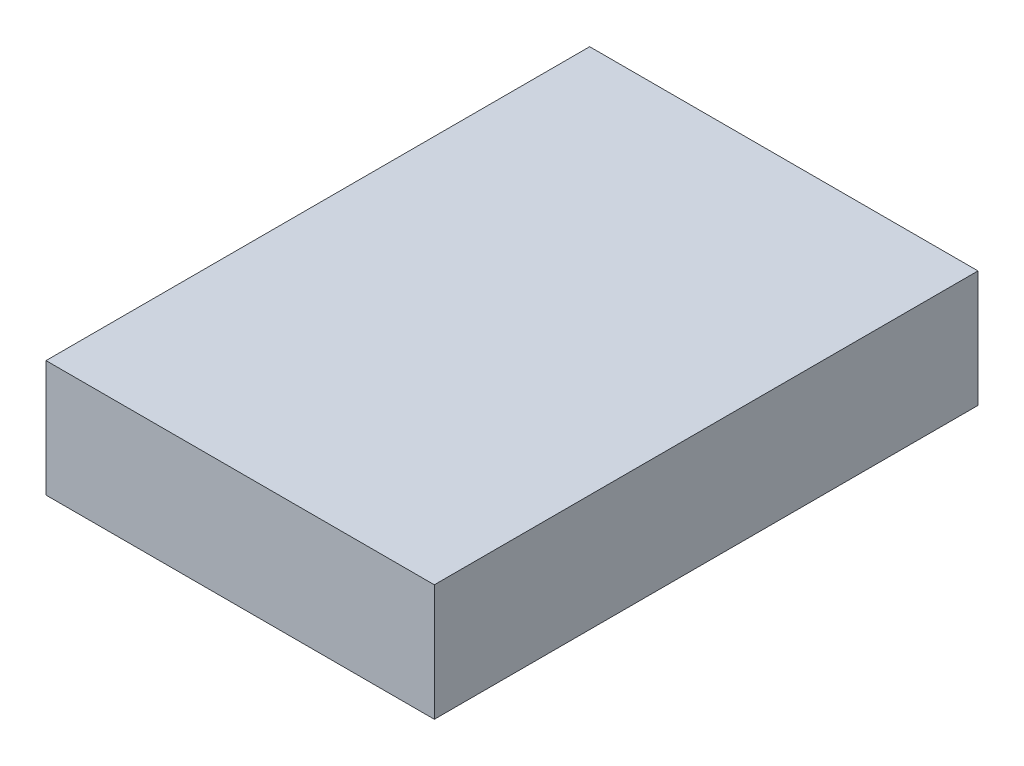
ISO-10303-21;
HEADER;
FILE_DESCRIPTION(('STEP AP214'),'2;1');
FILE_NAME('part.step','',(''),(''),'','','');
FILE_SCHEMA(('AUTOMOTIVE_DESIGN { 1 0 10303 214 1 1 1 1 }'));
ENDSEC;
DATA;
#1=APPLICATION_CONTEXT('core data for automotive mechanical design processes');
#2=APPLICATION_PROTOCOL_DEFINITION('international standard','automotive_design',2000,#1);
#3=PRODUCT_CONTEXT('',#1,'mechanical');
#4=PRODUCT('Part','Part','',(#3));
#5=PRODUCT_RELATED_PRODUCT_CATEGORY('part','',(#4));
#6=PRODUCT_DEFINITION_FORMATION('','',#4);
#7=PRODUCT_DEFINITION_CONTEXT('part definition',#1,'design');
#8=PRODUCT_DEFINITION('design','',#6,#7);
#9=PRODUCT_DEFINITION_SHAPE('','',#8);
#10=(LENGTH_UNIT() NAMED_UNIT(*) SI_UNIT(.MILLI.,.METRE.));
#11=(NAMED_UNIT(*) PLANE_ANGLE_UNIT() SI_UNIT($,.RADIAN.));
#12=(NAMED_UNIT(*) SI_UNIT($,.STERADIAN.) SOLID_ANGLE_UNIT());
#13=UNCERTAINTY_MEASURE_WITH_UNIT(LENGTH_MEASURE(1.E-05),#10,'distance_accuracy_value','');
#14=(GEOMETRIC_REPRESENTATION_CONTEXT(3) GLOBAL_UNCERTAINTY_ASSIGNED_CONTEXT((#13)) GLOBAL_UNIT_ASSIGNED_CONTEXT((#10,
#11,#12)) REPRESENTATION_CONTEXT('',''));
#15=CARTESIAN_POINT('',(0.,0.,0.));
#16=DIRECTION('',(0.,0.,1.));
#17=DIRECTION('',(1.,0.,0.));
#18=AXIS2_PLACEMENT_3D('',#15,#16,#17);
#19=CARTESIAN_POINT('',(-69.4972222222222,19.05,-30.8680555555555));
#20=DIRECTION('',(1.,0.,0.));
#21=DIRECTION('',(0.,0.,-1.));
#22=AXIS2_PLACEMENT_3D('',#19,#20,#21);
#23=PLANE('',#22);
#24=DIRECTION('',(0.,0.,1.));
#25=VECTOR('',#24,1.);
#26=CARTESIAN_POINT('',(-69.4972222222222,0.,-30.8680555555555));
#27=LINE('',#26,#25);
#28=CARTESIAN_POINT('',(-69.4972222222222,0.,-30.8680555555555));
#29=VERTEX_POINT('',#28);
#30=CARTESIAN_POINT('',(-69.4972222222222,0.,58.0319444444444));
#31=VERTEX_POINT('',#30);
#32=EDGE_CURVE('E96',#29,#31,#27,.T.);
#33=ORIENTED_EDGE('',*,*,#32,.T.);
#34=DIRECTION('',(0.,-1.,0.));
#35=VECTOR('',#34,1.);
#36=CARTESIAN_POINT('',(-69.4972222222222,19.05,58.0319444444444));
#37=LINE('',#36,#35);
#38=CARTESIAN_POINT('',(-69.4972222222222,19.05,58.0319444444444));
#39=VERTEX_POINT('',#38);
#40=EDGE_CURVE('E11',#39,#31,#37,.T.);
#41=ORIENTED_EDGE('',*,*,#40,.F.);
#42=DIRECTION('',(0.,0.,1.));
#43=VECTOR('',#42,1.);
#44=CARTESIAN_POINT('',(-69.4972222222222,19.05,-30.8680555555555));
#45=LINE('',#44,#43);
#46=CARTESIAN_POINT('',(-69.4972222222222,19.05,-30.8680555555555));
#47=VERTEX_POINT('',#46);
#48=EDGE_CURVE('E84',#47,#39,#45,.T.);
#49=ORIENTED_EDGE('',*,*,#48,.F.);
#50=DIRECTION('',(0.,-1.,0.));
#51=VECTOR('',#50,1.);
#52=CARTESIAN_POINT('',(-69.4972222222222,19.05,-30.8680555555555));
#53=LINE('',#52,#51);
#54=EDGE_CURVE('E92',#47,#29,#53,.T.);
#55=ORIENTED_EDGE('',*,*,#54,.T.);
#56=EDGE_LOOP('',(#33,#41,#49,#55));
#57=FACE_BOUND('',#56,.T.);
#58=ADVANCED_FACE('F33',(#57),#23,.F.);
#59=CARTESIAN_POINT('',(-69.4972222222222,19.05,58.0319444444444));
#60=DIRECTION('',(0.,0.,-1.));
#61=DIRECTION('',(-1.,0.,0.));
#62=AXIS2_PLACEMENT_3D('',#59,#60,#61);
#63=PLANE('',#62);
#64=DIRECTION('',(1.,0.,0.));
#65=VECTOR('',#64,1.);
#66=CARTESIAN_POINT('',(-69.4972222222222,0.,58.0319444444444));
#67=LINE('',#66,#65);
#68=CARTESIAN_POINT('',(-5.99722222222221,0.,58.0319444444444));
#69=VERTEX_POINT('',#68);
#70=EDGE_CURVE('E88',#31,#69,#67,.T.);
#71=ORIENTED_EDGE('',*,*,#70,.T.);
#72=DIRECTION('',(0.,-1.,0.));
#73=VECTOR('',#72,1.);
#74=CARTESIAN_POINT('',(-5.99722222222221,19.05,58.0319444444444));
#75=LINE('',#74,#73);
#76=CARTESIAN_POINT('',(-5.99722222222221,19.05,58.0319444444444));
#77=VERTEX_POINT('',#76);
#78=EDGE_CURVE('E41',#77,#69,#75,.T.);
#79=ORIENTED_EDGE('',*,*,#78,.F.);
#80=DIRECTION('',(1.,0.,0.));
#81=VECTOR('',#80,1.);
#82=CARTESIAN_POINT('',(-69.4972222222222,19.05,58.0319444444444));
#83=LINE('',#82,#81);
#84=EDGE_CURVE('E79',#39,#77,#83,.T.);
#85=ORIENTED_EDGE('',*,*,#84,.F.);
#86=ORIENTED_EDGE('',*,*,#40,.T.);
#87=EDGE_LOOP('',(#71,#79,#85,#86));
#88=FACE_BOUND('',#87,.T.);
#89=ADVANCED_FACE('F87',(#88),#63,.F.);
#90=CARTESIAN_POINT('',(-5.99722222222224,19.05,-30.8680555555555));
#91=DIRECTION('',(-1.,0.,0.));
#92=DIRECTION('',(0.,0.,1.));
#93=AXIS2_PLACEMENT_3D('',#90,#91,#92);
#94=PLANE('',#93);
#95=DIRECTION('',(0.,0.,-1.));
#96=VECTOR('',#95,1.);
#97=CARTESIAN_POINT('',(-5.99722222222224,0.,-30.8680555555555));
#98=LINE('',#97,#96);
#99=CARTESIAN_POINT('',(-5.99722222222224,0.,-30.8680555555555));
#100=VERTEX_POINT('',#99);
#101=EDGE_CURVE('E66',#69,#100,#98,.T.);
#102=ORIENTED_EDGE('',*,*,#101,.T.);
#103=DIRECTION('',(0.,-1.,0.));
#104=VECTOR('',#103,1.);
#105=CARTESIAN_POINT('',(-5.99722222222224,19.05,-30.8680555555555));
#106=LINE('',#105,#104);
#107=CARTESIAN_POINT('',(-5.99722222222224,19.05,-30.8680555555555));
#108=VERTEX_POINT('',#107);
#109=EDGE_CURVE('E89',#108,#100,#106,.T.);
#110=ORIENTED_EDGE('',*,*,#109,.F.);
#111=DIRECTION('',(0.,0.,-1.));
#112=VECTOR('',#111,1.);
#113=CARTESIAN_POINT('',(-5.99722222222224,19.05,-30.8680555555555));
#114=LINE('',#113,#112);
#115=EDGE_CURVE('E82',#77,#108,#114,.T.);
#116=ORIENTED_EDGE('',*,*,#115,.F.);
#117=ORIENTED_EDGE('',*,*,#78,.T.);
#118=EDGE_LOOP('',(#102,#110,#116,#117));
#119=FACE_BOUND('',#118,.T.);
#120=ADVANCED_FACE('F90',(#119),#94,.F.);
#121=CARTESIAN_POINT('',(-69.4972222222222,19.05,-30.8680555555555));
#122=DIRECTION('',(0.,0.,1.));
#123=DIRECTION('',(1.,0.,0.));
#124=AXIS2_PLACEMENT_3D('',#121,#122,#123);
#125=PLANE('',#124);
#126=DIRECTION('',(-1.,0.,0.));
#127=VECTOR('',#126,1.);
#128=CARTESIAN_POINT('',(-69.4972222222222,0.,-30.8680555555555));
#129=LINE('',#128,#127);
#130=EDGE_CURVE('E72',#100,#29,#129,.T.);
#131=ORIENTED_EDGE('',*,*,#130,.T.);
#132=ORIENTED_EDGE('',*,*,#54,.F.);
#133=DIRECTION('',(-1.,0.,0.));
#134=VECTOR('',#133,1.);
#135=CARTESIAN_POINT('',(-69.4972222222222,19.05,-30.8680555555555));
#136=LINE('',#135,#134);
#137=EDGE_CURVE('E49',#108,#47,#136,.T.);
#138=ORIENTED_EDGE('',*,*,#137,.F.);
#139=ORIENTED_EDGE('',*,*,#109,.T.);
#140=EDGE_LOOP('',(#131,#132,#138,#139));
#141=FACE_BOUND('',#140,.T.);
#142=ADVANCED_FACE('F103',(#141),#125,.F.);
#143=CARTESIAN_POINT('',(0.,19.05,0.));
#144=DIRECTION('',(0.,1.,0.));
#145=DIRECTION('',(0.,0.,1.));
#146=AXIS2_PLACEMENT_3D('',#143,#144,#145);
#147=PLANE('',#146);
#148=ORIENTED_EDGE('',*,*,#48,.T.);
#149=ORIENTED_EDGE('',*,*,#84,.T.);
#150=ORIENTED_EDGE('',*,*,#115,.T.);
#151=ORIENTED_EDGE('',*,*,#137,.T.);
#152=EDGE_LOOP('',(#148,#149,#150,#151));
#153=FACE_BOUND('',#152,.T.);
#154=ADVANCED_FACE('F80',(#153),#147,.T.);
#155=CARTESIAN_POINT('',(0.,0.,0.));
#156=DIRECTION('',(0.,1.,0.));
#157=DIRECTION('',(0.,0.,1.));
#158=AXIS2_PLACEMENT_3D('',#155,#156,#157);
#159=PLANE('',#158);
#160=ORIENTED_EDGE('',*,*,#32,.F.);
#161=ORIENTED_EDGE('',*,*,#130,.F.);
#162=ORIENTED_EDGE('',*,*,#101,.F.);
#163=ORIENTED_EDGE('',*,*,#70,.F.);
#164=EDGE_LOOP('',(#160,#161,#162,#163));
#165=FACE_BOUND('',#164,.T.);
#166=ADVANCED_FACE('F106',(#165),#159,.F.);
#167=CLOSED_SHELL('',(#58,#89,#120,#142,#154,#166));
#168=MANIFOLD_SOLID_BREP('B2',#167);
#169=ADVANCED_BREP_SHAPE_REPRESENTATION('',(#18,#168),#14);
#170=SHAPE_DEFINITION_REPRESENTATION(#9,#169);
ENDSEC;
END-ISO-10303-21;
